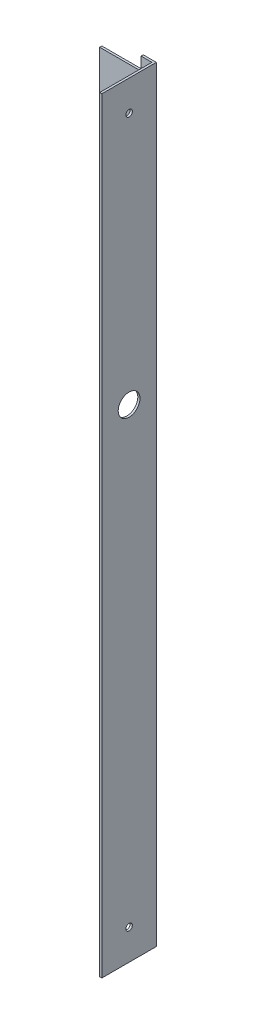
ISO-10303-21;
HEADER;
FILE_DESCRIPTION(('STEP AP214'),'2;1');
FILE_NAME('part.step','',(''),(''),'','','');
FILE_SCHEMA(('AUTOMOTIVE_DESIGN { 1 0 10303 214 1 1 1 1 }'));
ENDSEC;
DATA;
#1=APPLICATION_CONTEXT('core data for automotive mechanical design processes');
#2=APPLICATION_PROTOCOL_DEFINITION('international standard','automotive_design',2000,#1);
#3=PRODUCT_CONTEXT('',#1,'mechanical');
#4=PRODUCT('Part','Part','',(#3));
#5=PRODUCT_RELATED_PRODUCT_CATEGORY('part','',(#4));
#6=PRODUCT_DEFINITION_FORMATION('','',#4);
#7=PRODUCT_DEFINITION_CONTEXT('part definition',#1,'design');
#8=PRODUCT_DEFINITION('design','',#6,#7);
#9=PRODUCT_DEFINITION_SHAPE('','',#8);
#10=(LENGTH_UNIT() NAMED_UNIT(*) SI_UNIT(.MILLI.,.METRE.));
#11=(NAMED_UNIT(*) PLANE_ANGLE_UNIT() SI_UNIT($,.RADIAN.));
#12=(NAMED_UNIT(*) SI_UNIT($,.STERADIAN.) SOLID_ANGLE_UNIT());
#13=UNCERTAINTY_MEASURE_WITH_UNIT(LENGTH_MEASURE(1.E-05),#10,'distance_accuracy_value','');
#14=(GEOMETRIC_REPRESENTATION_CONTEXT(3) GLOBAL_UNCERTAINTY_ASSIGNED_CONTEXT((#13)) GLOBAL_UNIT_ASSIGNED_CONTEXT((#10,
#11,#12)) REPRESENTATION_CONTEXT('',''));
#15=CARTESIAN_POINT('',(0.,0.,0.));
#16=DIRECTION('',(0.,0.,1.));
#17=DIRECTION('',(1.,0.,0.));
#18=AXIS2_PLACEMENT_3D('',#15,#16,#17);
#19=CARTESIAN_POINT('',(-56.3400048408916,62.1803752262785,25.));
#20=DIRECTION('',(1.,0.,0.));
#21=DIRECTION('',(0.,1.,0.));
#22=AXIS2_PLACEMENT_3D('',#19,#20,#21);
#23=PLANE('',#22);
#24=CARTESIAN_POINT('',(-56.3400048408916,48.1803752262785,12.5));
#25=DIRECTION('',(1.,0.,0.));
#26=DIRECTION('',(0.,1.,0.));
#27=AXIS2_PLACEMENT_3D('',#24,#25,#26);
#28=CIRCLE('',#27,1.5);
#29=CARTESIAN_POINT('',(-56.3400048408916,49.6803752262785,12.5));
#30=VERTEX_POINT('',#29);
#31=EDGE_CURVE('E188',#30,#30,#28,.T.);
#32=ORIENTED_EDGE('',*,*,#31,.T.);
#33=EDGE_LOOP('',(#32));
#34=FACE_BOUND('',#33,.T.);
#35=CARTESIAN_POINT('',(-56.3400048408916,-275.819624773722,12.5));
#36=DIRECTION('',(1.,0.,0.));
#37=DIRECTION('',(0.,1.,0.));
#38=AXIS2_PLACEMENT_3D('',#35,#36,#37);
#39=CIRCLE('',#38,1.5);
#40=CARTESIAN_POINT('',(-56.3400048408916,-274.319624773722,12.5));
#41=VERTEX_POINT('',#40);
#42=EDGE_CURVE('E182',#41,#41,#39,.T.);
#43=ORIENTED_EDGE('',*,*,#42,.T.);
#44=EDGE_LOOP('',(#43));
#45=FACE_BOUND('',#44,.T.);
#46=CARTESIAN_POINT('',(-56.3400048408916,-67.8196247737215,12.5));
#47=DIRECTION('',(1.,0.,0.));
#48=DIRECTION('',(0.,1.,0.));
#49=AXIS2_PLACEMENT_3D('',#46,#47,#48);
#50=CIRCLE('',#49,5.00000000000001);
#51=CARTESIAN_POINT('',(-56.3400048408916,-62.8196247737215,12.5));
#52=VERTEX_POINT('',#51);
#53=EDGE_CURVE('E173',#52,#52,#50,.T.);
#54=ORIENTED_EDGE('',*,*,#53,.T.);
#55=EDGE_LOOP('',(#54));
#56=FACE_BOUND('',#55,.T.);
#57=DIRECTION('',(0.,1.,0.));
#58=VECTOR('',#57,1.);
#59=CARTESIAN_POINT('',(-56.3400048408916,-289.819624773722,1.));
#60=LINE('',#59,#58);
#61=CARTESIAN_POINT('',(-56.3400048408916,-289.819624773722,1.));
#62=VERTEX_POINT('',#61);
#63=CARTESIAN_POINT('',(-56.3400048408916,62.1803752262785,1.));
#64=VERTEX_POINT('',#63);
#65=EDGE_CURVE('E49',#62,#64,#60,.T.);
#66=ORIENTED_EDGE('',*,*,#65,.F.);
#67=DIRECTION('',(0.,0.,-1.));
#68=VECTOR('',#67,1.);
#69=CARTESIAN_POINT('',(-56.3400048408916,-289.819624773722,25.));
#70=LINE('',#69,#68);
#71=CARTESIAN_POINT('',(-56.3400048408916,-289.819624773722,25.));
#72=VERTEX_POINT('',#71);
#73=EDGE_CURVE('E11',#72,#62,#70,.T.);
#74=ORIENTED_EDGE('',*,*,#73,.F.);
#75=DIRECTION('',(0.,-1.,0.));
#76=VECTOR('',#75,1.);
#77=CARTESIAN_POINT('',(-56.3400048408916,62.1803752262785,25.));
#78=LINE('',#77,#76);
#79=CARTESIAN_POINT('',(-56.3400048408916,62.1803752262785,25.));
#80=VERTEX_POINT('',#79);
#81=EDGE_CURVE('E194',#80,#72,#78,.T.);
#82=ORIENTED_EDGE('',*,*,#81,.F.);
#83=DIRECTION('',(0.,0.,-1.));
#84=VECTOR('',#83,1.);
#85=CARTESIAN_POINT('',(-56.3400048408916,62.1803752262785,25.));
#86=LINE('',#85,#84);
#87=EDGE_CURVE('E201',#80,#64,#86,.T.);
#88=ORIENTED_EDGE('',*,*,#87,.T.);
#89=EDGE_LOOP('',(#66,#74,#82,#88));
#90=FACE_BOUND('',#89,.T.);
#91=ADVANCED_FACE('F33',(#34,#45,#56,#90),#23,.F.);
#92=CARTESIAN_POINT('',(-56.3400048408916,-289.819624773722,25.));
#93=DIRECTION('',(0.,1.,0.));
#94=DIRECTION('',(0.,0.,1.));
#95=AXIS2_PLACEMENT_3D('',#92,#93,#94);
#96=PLANE('',#95);
#97=DIRECTION('',(1.,0.,0.));
#98=VECTOR('',#97,1.);
#99=CARTESIAN_POINT('',(-56.3400048408916,-289.819624773722,0.));
#100=LINE('',#99,#98);
#101=CARTESIAN_POINT('',(-61.3400048408916,-289.819624773722,0.));
#102=VERTEX_POINT('',#101);
#103=CARTESIAN_POINT('',(-55.3400048408916,-289.819624773722,0.));
#104=VERTEX_POINT('',#103);
#105=EDGE_CURVE('E191',#102,#104,#100,.T.);
#106=ORIENTED_EDGE('',*,*,#105,.T.);
#107=DIRECTION('',(0.,0.,-1.));
#108=VECTOR('',#107,1.);
#109=CARTESIAN_POINT('',(-55.3400048408916,-289.819624773722,25.));
#110=LINE('',#109,#108);
#111=CARTESIAN_POINT('',(-55.3400048408916,-289.819624773722,25.));
#112=VERTEX_POINT('',#111);
#113=EDGE_CURVE('E41',#112,#104,#110,.T.);
#114=ORIENTED_EDGE('',*,*,#113,.F.);
#115=DIRECTION('',(1.,0.,0.));
#116=VECTOR('',#115,1.);
#117=CARTESIAN_POINT('',(-56.3400048408916,-289.819624773722,25.));
#118=LINE('',#117,#116);
#119=EDGE_CURVE('E80',#72,#112,#118,.T.);
#120=ORIENTED_EDGE('',*,*,#119,.F.);
#121=ORIENTED_EDGE('',*,*,#73,.T.);
#122=DIRECTION('',(1.,0.,0.));
#123=VECTOR('',#122,1.);
#124=CARTESIAN_POINT('',(-61.3400048408916,-289.819624773722,1.));
#125=LINE('',#124,#123);
#126=CARTESIAN_POINT('',(-61.3400048408916,-289.819624773722,1.));
#127=VERTEX_POINT('',#126);
#128=EDGE_CURVE('E214',#127,#62,#125,.T.);
#129=ORIENTED_EDGE('',*,*,#128,.F.);
#130=DIRECTION('',(0.,0.,-1.));
#131=VECTOR('',#130,1.);
#132=CARTESIAN_POINT('',(-61.3400048408916,-289.819624773722,1.));
#133=LINE('',#132,#131);
#134=EDGE_CURVE('E240',#127,#102,#133,.T.);
#135=ORIENTED_EDGE('',*,*,#134,.T.);
#136=EDGE_LOOP('',(#106,#114,#120,#121,#129,#135));
#137=FACE_BOUND('',#136,.T.);
#138=ADVANCED_FACE('F296',(#137),#96,.F.);
#139=CARTESIAN_POINT('',(-55.3400048408916,62.1803752262785,25.));
#140=DIRECTION('',(-1.,0.,0.));
#141=DIRECTION('',(0.,-1.,0.));
#142=AXIS2_PLACEMENT_3D('',#139,#140,#141);
#143=PLANE('',#142);
#144=CARTESIAN_POINT('',(-55.3400048408916,-67.8196247737215,12.5));
#145=DIRECTION('',(1.,0.,0.));
#146=DIRECTION('',(0.,1.,0.));
#147=AXIS2_PLACEMENT_3D('',#144,#145,#146);
#148=CIRCLE('',#147,5.00000000000001);
#149=CARTESIAN_POINT('',(-55.3400048408916,-62.8196247737215,12.5));
#150=VERTEX_POINT('',#149);
#151=EDGE_CURVE('E170',#150,#150,#148,.T.);
#152=ORIENTED_EDGE('',*,*,#151,.F.);
#153=EDGE_LOOP('',(#152));
#154=FACE_BOUND('',#153,.T.);
#155=CARTESIAN_POINT('',(-55.3400048408916,-275.819624773722,12.5));
#156=DIRECTION('',(1.,0.,0.));
#157=DIRECTION('',(0.,1.,0.));
#158=AXIS2_PLACEMENT_3D('',#155,#156,#157);
#159=CIRCLE('',#158,1.5);
#160=CARTESIAN_POINT('',(-55.3400048408916,-274.319624773722,12.5));
#161=VERTEX_POINT('',#160);
#162=EDGE_CURVE('E180',#161,#161,#159,.T.);
#163=ORIENTED_EDGE('',*,*,#162,.F.);
#164=EDGE_LOOP('',(#163));
#165=FACE_BOUND('',#164,.T.);
#166=CARTESIAN_POINT('',(-55.3400048408916,48.1803752262785,12.5));
#167=DIRECTION('',(1.,0.,0.));
#168=DIRECTION('',(0.,1.,0.));
#169=AXIS2_PLACEMENT_3D('',#166,#167,#168);
#170=CIRCLE('',#169,1.5);
#171=CARTESIAN_POINT('',(-55.3400048408916,49.6803752262785,12.5));
#172=VERTEX_POINT('',#171);
#173=EDGE_CURVE('E185',#172,#172,#170,.T.);
#174=ORIENTED_EDGE('',*,*,#173,.F.);
#175=EDGE_LOOP('',(#174));
#176=FACE_BOUND('',#175,.T.);
#177=DIRECTION('',(0.,1.,0.));
#178=VECTOR('',#177,1.);
#179=CARTESIAN_POINT('',(-55.3400048408916,62.1803752262785,0.));
#180=LINE('',#179,#178);
#181=CARTESIAN_POINT('',(-55.3400048408916,62.1803752262785,0.));
#182=VERTEX_POINT('',#181);
#183=EDGE_CURVE('E73',#104,#182,#180,.T.);
#184=ORIENTED_EDGE('',*,*,#183,.T.);
#185=DIRECTION('',(0.,0.,-1.));
#186=VECTOR('',#185,1.);
#187=CARTESIAN_POINT('',(-55.3400048408916,62.1803752262785,25.));
#188=LINE('',#187,#186);
#189=CARTESIAN_POINT('',(-55.3400048408916,62.1803752262785,25.));
#190=VERTEX_POINT('',#189);
#191=EDGE_CURVE('E207',#190,#182,#188,.T.);
#192=ORIENTED_EDGE('',*,*,#191,.F.);
#193=DIRECTION('',(0.,1.,0.));
#194=VECTOR('',#193,1.);
#195=CARTESIAN_POINT('',(-55.3400048408916,62.1803752262785,25.));
#196=LINE('',#195,#194);
#197=EDGE_CURVE('E198',#112,#190,#196,.T.);
#198=ORIENTED_EDGE('',*,*,#197,.F.);
#199=ORIENTED_EDGE('',*,*,#113,.T.);
#200=EDGE_LOOP('',(#184,#192,#198,#199));
#201=FACE_BOUND('',#200,.T.);
#202=ADVANCED_FACE('F300',(#154,#165,#176,#201),#143,.F.);
#203=CARTESIAN_POINT('',(-56.3400048408916,62.1803752262785,25.));
#204=DIRECTION('',(0.,-1.,0.));
#205=DIRECTION('',(0.,0.,-1.));
#206=AXIS2_PLACEMENT_3D('',#203,#204,#205);
#207=PLANE('',#206);
#208=DIRECTION('',(-1.,0.,0.));
#209=VECTOR('',#208,1.);
#210=CARTESIAN_POINT('',(-56.3400048408916,62.1803752262785,0.));
#211=LINE('',#210,#209);
#212=CARTESIAN_POINT('',(-61.3400048408916,62.1803752262785,0.));
#213=VERTEX_POINT('',#212);
#214=EDGE_CURVE('E196',#182,#213,#211,.T.);
#215=ORIENTED_EDGE('',*,*,#214,.T.);
#216=DIRECTION('',(0.,0.,-1.));
#217=VECTOR('',#216,1.);
#218=CARTESIAN_POINT('',(-61.3400048408916,62.1803752262785,1.));
#219=LINE('',#218,#217);
#220=CARTESIAN_POINT('',(-61.3400048408916,62.1803752262785,1.));
#221=VERTEX_POINT('',#220);
#222=EDGE_CURVE('E238',#221,#213,#219,.T.);
#223=ORIENTED_EDGE('',*,*,#222,.F.);
#224=DIRECTION('',(-1.,0.,0.));
#225=VECTOR('',#224,1.);
#226=CARTESIAN_POINT('',(-56.3400048408916,62.1803752262785,1.));
#227=LINE('',#226,#225);
#228=EDGE_CURVE('E161',#64,#221,#227,.T.);
#229=ORIENTED_EDGE('',*,*,#228,.F.);
#230=ORIENTED_EDGE('',*,*,#87,.F.);
#231=DIRECTION('',(-1.,0.,0.));
#232=VECTOR('',#231,1.);
#233=CARTESIAN_POINT('',(-56.3400048408916,62.1803752262785,25.));
#234=LINE('',#233,#232);
#235=EDGE_CURVE('E57',#190,#80,#234,.T.);
#236=ORIENTED_EDGE('',*,*,#235,.F.);
#237=ORIENTED_EDGE('',*,*,#191,.T.);
#238=EDGE_LOOP('',(#215,#223,#229,#230,#236,#237));
#239=FACE_BOUND('',#238,.T.);
#240=ADVANCED_FACE('F303',(#239),#207,.F.);
#241=CARTESIAN_POINT('',(0.,0.,25.));
#242=DIRECTION('',(0.,0.,1.));
#243=DIRECTION('',(1.,0.,0.));
#244=AXIS2_PLACEMENT_3D('',#241,#242,#243);
#245=PLANE('',#244);
#246=ORIENTED_EDGE('',*,*,#81,.T.);
#247=ORIENTED_EDGE('',*,*,#119,.T.);
#248=ORIENTED_EDGE('',*,*,#197,.T.);
#249=ORIENTED_EDGE('',*,*,#235,.T.);
#250=EDGE_LOOP('',(#246,#247,#248,#249));
#251=FACE_BOUND('',#250,.T.);
#252=ADVANCED_FACE('F298',(#251),#245,.T.);
#253=CARTESIAN_POINT('',(0.,0.,0.));
#254=DIRECTION('',(0.,0.,1.));
#255=DIRECTION('',(1.,0.,0.));
#256=AXIS2_PLACEMENT_3D('',#253,#254,#255);
#257=PLANE('',#256);
#258=ORIENTED_EDGE('',*,*,#105,.F.);
#259=DIRECTION('',(0.,-1.,0.));
#260=VECTOR('',#259,1.);
#261=CARTESIAN_POINT('',(-61.3400048408916,-283.819624773722,0.));
#262=LINE('',#261,#260);
#263=CARTESIAN_POINT('',(-61.3400048408916,-283.819624773722,0.));
#264=VERTEX_POINT('',#263);
#265=EDGE_CURVE('E165',#264,#102,#262,.T.);
#266=ORIENTED_EDGE('',*,*,#265,.F.);
#267=DIRECTION('',(1.,0.,0.));
#268=VECTOR('',#267,1.);
#269=CARTESIAN_POINT('',(-80.3400048408922,-283.819624773722,0.));
#270=LINE('',#269,#268);
#271=CARTESIAN_POINT('',(-80.3400048408922,-283.819624773722,0.));
#272=VERTEX_POINT('',#271);
#273=EDGE_CURVE('E234',#272,#264,#270,.T.);
#274=ORIENTED_EDGE('',*,*,#273,.F.);
#275=DIRECTION('',(0.,-1.,0.));
#276=VECTOR('',#275,1.);
#277=CARTESIAN_POINT('',(-80.3400048408922,-213.819624773722,0.));
#278=LINE('',#277,#276);
#279=CARTESIAN_POINT('',(-80.3400048408922,-213.819624773722,0.));
#280=VERTEX_POINT('',#279);
#281=EDGE_CURVE('E232',#280,#272,#278,.T.);
#282=ORIENTED_EDGE('',*,*,#281,.F.);
#283=DIRECTION('',(-1.,0.,0.));
#284=VECTOR('',#283,1.);
#285=CARTESIAN_POINT('',(-61.3400048408916,-213.819624773722,0.));
#286=LINE('',#285,#284);
#287=CARTESIAN_POINT('',(-61.3400048408916,-213.819624773722,0.));
#288=VERTEX_POINT('',#287);
#289=EDGE_CURVE('E230',#288,#280,#286,.T.);
#290=ORIENTED_EDGE('',*,*,#289,.F.);
#291=DIRECTION('',(0.,-1.,0.));
#292=VECTOR('',#291,1.);
#293=CARTESIAN_POINT('',(-61.3400048408916,-13.8196247737216,0.));
#294=LINE('',#293,#292);
#295=CARTESIAN_POINT('',(-61.3400048408916,-13.8196247737216,0.));
#296=VERTEX_POINT('',#295);
#297=EDGE_CURVE('E228',#296,#288,#294,.T.);
#298=ORIENTED_EDGE('',*,*,#297,.F.);
#299=DIRECTION('',(1.,0.,0.));
#300=VECTOR('',#299,1.);
#301=CARTESIAN_POINT('',(-80.3400048408922,-13.8196247737216,0.));
#302=LINE('',#301,#300);
#303=CARTESIAN_POINT('',(-80.3400048408922,-13.8196247737216,0.));
#304=VERTEX_POINT('',#303);
#305=EDGE_CURVE('E226',#304,#296,#302,.T.);
#306=ORIENTED_EDGE('',*,*,#305,.F.);
#307=DIRECTION('',(0.,-1.,0.));
#308=VECTOR('',#307,1.);
#309=CARTESIAN_POINT('',(-80.3400048408922,56.1803752262785,0.));
#310=LINE('',#309,#308);
#311=CARTESIAN_POINT('',(-80.3400048408922,56.1803752262785,0.));
#312=VERTEX_POINT('',#311);
#313=EDGE_CURVE('E224',#312,#304,#310,.T.);
#314=ORIENTED_EDGE('',*,*,#313,.F.);
#315=DIRECTION('',(-1.,0.,0.));
#316=VECTOR('',#315,1.);
#317=CARTESIAN_POINT('',(-61.3400048408916,56.1803752262785,0.));
#318=LINE('',#317,#316);
#319=CARTESIAN_POINT('',(-61.3400048408916,56.1803752262785,0.));
#320=VERTEX_POINT('',#319);
#321=EDGE_CURVE('E222',#320,#312,#318,.T.);
#322=ORIENTED_EDGE('',*,*,#321,.F.);
#323=DIRECTION('',(0.,-1.,0.));
#324=VECTOR('',#323,1.);
#325=CARTESIAN_POINT('',(-61.3400048408916,62.1803752262785,0.));
#326=LINE('',#325,#324);
#327=EDGE_CURVE('E169',#213,#320,#326,.T.);
#328=ORIENTED_EDGE('',*,*,#327,.F.);
#329=ORIENTED_EDGE('',*,*,#214,.F.);
#330=ORIENTED_EDGE('',*,*,#183,.F.);
#331=EDGE_LOOP('',(#258,#266,#274,#282,#290,#298,#306,#314,#322,#328,#329,#330));
#332=FACE_BOUND('',#331,.T.);
#333=ADVANCED_FACE('F269',(#332),#257,.F.);
#334=CARTESIAN_POINT('',(-56.3400048408916,48.1803752262785,12.5));
#335=DIRECTION('',(1.,0.,0.));
#336=DIRECTION('',(0.,1.,0.));
#337=AXIS2_PLACEMENT_3D('',#334,#335,#336);
#338=CYLINDRICAL_SURFACE('',#337,1.5);
#339=ORIENTED_EDGE('',*,*,#31,.F.);
#340=EDGE_LOOP('',(#339));
#341=FACE_BOUND('',#340,.T.);
#342=ORIENTED_EDGE('',*,*,#173,.T.);
#343=EDGE_LOOP('',(#342));
#344=FACE_BOUND('',#343,.T.);
#345=ADVANCED_FACE('F339',(#341,#344),#338,.F.);
#346=CARTESIAN_POINT('',(-56.3400048408916,-275.819624773722,12.5));
#347=DIRECTION('',(1.,0.,0.));
#348=DIRECTION('',(0.,1.,0.));
#349=AXIS2_PLACEMENT_3D('',#346,#347,#348);
#350=CYLINDRICAL_SURFACE('',#349,1.5);
#351=ORIENTED_EDGE('',*,*,#42,.F.);
#352=EDGE_LOOP('',(#351));
#353=FACE_BOUND('',#352,.T.);
#354=ORIENTED_EDGE('',*,*,#162,.T.);
#355=EDGE_LOOP('',(#354));
#356=FACE_BOUND('',#355,.T.);
#357=ADVANCED_FACE('F328',(#353,#356),#350,.F.);
#358=CARTESIAN_POINT('',(-56.3400048408916,-67.8196247737215,12.5));
#359=DIRECTION('',(1.,0.,0.));
#360=DIRECTION('',(0.,1.,0.));
#361=AXIS2_PLACEMENT_3D('',#358,#359,#360);
#362=CYLINDRICAL_SURFACE('',#361,5.00000000000001);
#363=ORIENTED_EDGE('',*,*,#53,.F.);
#364=EDGE_LOOP('',(#363));
#365=FACE_BOUND('',#364,.T.);
#366=ORIENTED_EDGE('',*,*,#151,.T.);
#367=EDGE_LOOP('',(#366));
#368=FACE_BOUND('',#367,.T.);
#369=ADVANCED_FACE('F325',(#365,#368),#362,.F.);
#370=CARTESIAN_POINT('',(-61.3400048408916,62.1803752262785,1.));
#371=DIRECTION('',(1.,0.,0.));
#372=DIRECTION('',(0.,0.,-1.));
#373=AXIS2_PLACEMENT_3D('',#370,#371,#372);
#374=PLANE('',#373);
#375=ORIENTED_EDGE('',*,*,#327,.T.);
#376=DIRECTION('',(0.,0.,-1.));
#377=VECTOR('',#376,1.);
#378=CARTESIAN_POINT('',(-61.3400048408916,56.1803752262785,1.));
#379=LINE('',#378,#377);
#380=CARTESIAN_POINT('',(-61.3400048408916,56.1803752262785,1.));
#381=VERTEX_POINT('',#380);
#382=EDGE_CURVE('E149',#381,#320,#379,.T.);
#383=ORIENTED_EDGE('',*,*,#382,.F.);
#384=DIRECTION('',(0.,-1.,0.));
#385=VECTOR('',#384,1.);
#386=CARTESIAN_POINT('',(-61.3400048408916,62.1803752262785,1.));
#387=LINE('',#386,#385);
#388=EDGE_CURVE('E156',#221,#381,#387,.T.);
#389=ORIENTED_EDGE('',*,*,#388,.F.);
#390=ORIENTED_EDGE('',*,*,#222,.T.);
#391=EDGE_LOOP('',(#375,#383,#389,#390));
#392=FACE_BOUND('',#391,.T.);
#393=ADVANCED_FACE('F167',(#392),#374,.F.);
#394=CARTESIAN_POINT('',(-61.3400048408916,56.1803752262785,1.));
#395=DIRECTION('',(0.,-1.,0.));
#396=DIRECTION('',(0.,0.,-1.));
#397=AXIS2_PLACEMENT_3D('',#394,#395,#396);
#398=PLANE('',#397);
#399=ORIENTED_EDGE('',*,*,#321,.T.);
#400=DIRECTION('',(0.,0.,-1.));
#401=VECTOR('',#400,1.);
#402=CARTESIAN_POINT('',(-80.3400048408922,56.1803752262785,1.));
#403=LINE('',#402,#401);
#404=CARTESIAN_POINT('',(-80.3400048408922,56.1803752262785,1.));
#405=VERTEX_POINT('',#404);
#406=EDGE_CURVE('E152',#405,#312,#403,.T.);
#407=ORIENTED_EDGE('',*,*,#406,.F.);
#408=DIRECTION('',(-1.,0.,0.));
#409=VECTOR('',#408,1.);
#410=CARTESIAN_POINT('',(-61.3400048408916,56.1803752262785,1.));
#411=LINE('',#410,#409);
#412=EDGE_CURVE('E145',#381,#405,#411,.T.);
#413=ORIENTED_EDGE('',*,*,#412,.F.);
#414=ORIENTED_EDGE('',*,*,#382,.T.);
#415=EDGE_LOOP('',(#399,#407,#413,#414));
#416=FACE_BOUND('',#415,.T.);
#417=ADVANCED_FACE('F147',(#416),#398,.F.);
#418=CARTESIAN_POINT('',(-80.3400048408922,56.1803752262785,1.));
#419=DIRECTION('',(1.,0.,0.));
#420=DIRECTION('',(0.,1.,0.));
#421=AXIS2_PLACEMENT_3D('',#418,#419,#420);
#422=PLANE('',#421);
#423=ORIENTED_EDGE('',*,*,#313,.T.);
#424=DIRECTION('',(0.,0.,-1.));
#425=VECTOR('',#424,1.);
#426=CARTESIAN_POINT('',(-80.3400048408922,-13.8196247737216,1.));
#427=LINE('',#426,#425);
#428=CARTESIAN_POINT('',(-80.3400048408922,-13.8196247737216,1.));
#429=VERTEX_POINT('',#428);
#430=EDGE_CURVE('E175',#429,#304,#427,.T.);
#431=ORIENTED_EDGE('',*,*,#430,.F.);
#432=DIRECTION('',(0.,-1.,0.));
#433=VECTOR('',#432,1.);
#434=CARTESIAN_POINT('',(-80.3400048408922,56.1803752262785,1.));
#435=LINE('',#434,#433);
#436=EDGE_CURVE('E155',#405,#429,#435,.T.);
#437=ORIENTED_EDGE('',*,*,#436,.F.);
#438=ORIENTED_EDGE('',*,*,#406,.T.);
#439=EDGE_LOOP('',(#423,#431,#437,#438));
#440=FACE_BOUND('',#439,.T.);
#441=ADVANCED_FACE('F304',(#440),#422,.F.);
#442=CARTESIAN_POINT('',(-80.3400048408922,-13.8196247737216,1.));
#443=DIRECTION('',(0.,1.,0.));
#444=DIRECTION('',(0.,0.,1.));
#445=AXIS2_PLACEMENT_3D('',#442,#443,#444);
#446=PLANE('',#445);
#447=ORIENTED_EDGE('',*,*,#305,.T.);
#448=DIRECTION('',(0.,0.,-1.));
#449=VECTOR('',#448,1.);
#450=CARTESIAN_POINT('',(-61.3400048408916,-13.8196247737216,1.));
#451=LINE('',#450,#449);
#452=CARTESIAN_POINT('',(-61.3400048408916,-13.8196247737216,1.));
#453=VERTEX_POINT('',#452);
#454=EDGE_CURVE('E255',#453,#296,#451,.T.);
#455=ORIENTED_EDGE('',*,*,#454,.F.);
#456=DIRECTION('',(1.,0.,0.));
#457=VECTOR('',#456,1.);
#458=CARTESIAN_POINT('',(-80.3400048408922,-13.8196247737216,1.));
#459=LINE('',#458,#457);
#460=EDGE_CURVE('E264',#429,#453,#459,.T.);
#461=ORIENTED_EDGE('',*,*,#460,.F.);
#462=ORIENTED_EDGE('',*,*,#430,.T.);
#463=EDGE_LOOP('',(#447,#455,#461,#462));
#464=FACE_BOUND('',#463,.T.);
#465=ADVANCED_FACE('F262',(#464),#446,.F.);
#466=CARTESIAN_POINT('',(-61.3400048408916,-13.8196247737216,1.));
#467=DIRECTION('',(1.,0.,0.));
#468=DIRECTION('',(0.,1.,0.));
#469=AXIS2_PLACEMENT_3D('',#466,#467,#468);
#470=PLANE('',#469);
#471=ORIENTED_EDGE('',*,*,#297,.T.);
#472=DIRECTION('',(0.,0.,-1.));
#473=VECTOR('',#472,1.);
#474=CARTESIAN_POINT('',(-61.3400048408916,-213.819624773722,1.));
#475=LINE('',#474,#473);
#476=CARTESIAN_POINT('',(-61.3400048408916,-213.819624773722,1.));
#477=VERTEX_POINT('',#476);
#478=EDGE_CURVE('E252',#477,#288,#475,.T.);
#479=ORIENTED_EDGE('',*,*,#478,.F.);
#480=DIRECTION('',(0.,-1.,0.));
#481=VECTOR('',#480,1.);
#482=CARTESIAN_POINT('',(-61.3400048408916,-13.8196247737216,1.));
#483=LINE('',#482,#481);
#484=EDGE_CURVE('E283',#453,#477,#483,.T.);
#485=ORIENTED_EDGE('',*,*,#484,.F.);
#486=ORIENTED_EDGE('',*,*,#454,.T.);
#487=EDGE_LOOP('',(#471,#479,#485,#486));
#488=FACE_BOUND('',#487,.T.);
#489=ADVANCED_FACE('F274',(#488),#470,.F.);
#490=CARTESIAN_POINT('',(-61.3400048408916,-213.819624773722,1.));
#491=DIRECTION('',(0.,-1.,0.));
#492=DIRECTION('',(1.,0.,0.));
#493=AXIS2_PLACEMENT_3D('',#490,#491,#492);
#494=PLANE('',#493);
#495=ORIENTED_EDGE('',*,*,#289,.T.);
#496=DIRECTION('',(0.,0.,-1.));
#497=VECTOR('',#496,1.);
#498=CARTESIAN_POINT('',(-80.3400048408922,-213.819624773722,1.));
#499=LINE('',#498,#497);
#500=CARTESIAN_POINT('',(-80.3400048408922,-213.819624773722,1.));
#501=VERTEX_POINT('',#500);
#502=EDGE_CURVE('E249',#501,#280,#499,.T.);
#503=ORIENTED_EDGE('',*,*,#502,.F.);
#504=DIRECTION('',(-1.,0.,0.));
#505=VECTOR('',#504,1.);
#506=CARTESIAN_POINT('',(-61.3400048408916,-213.819624773722,1.));
#507=LINE('',#506,#505);
#508=EDGE_CURVE('E280',#477,#501,#507,.T.);
#509=ORIENTED_EDGE('',*,*,#508,.F.);
#510=ORIENTED_EDGE('',*,*,#478,.T.);
#511=EDGE_LOOP('',(#495,#503,#509,#510));
#512=FACE_BOUND('',#511,.T.);
#513=ADVANCED_FACE('F278',(#512),#494,.F.);
#514=CARTESIAN_POINT('',(-80.3400048408922,-213.819624773722,1.));
#515=DIRECTION('',(1.,0.,0.));
#516=DIRECTION('',(0.,0.,-1.));
#517=AXIS2_PLACEMENT_3D('',#514,#515,#516);
#518=PLANE('',#517);
#519=ORIENTED_EDGE('',*,*,#281,.T.);
#520=DIRECTION('',(0.,0.,-1.));
#521=VECTOR('',#520,1.);
#522=CARTESIAN_POINT('',(-80.3400048408922,-283.819624773722,1.));
#523=LINE('',#522,#521);
#524=CARTESIAN_POINT('',(-80.3400048408922,-283.819624773722,1.));
#525=VERTEX_POINT('',#524);
#526=EDGE_CURVE('E246',#525,#272,#523,.T.);
#527=ORIENTED_EDGE('',*,*,#526,.F.);
#528=DIRECTION('',(0.,-1.,0.));
#529=VECTOR('',#528,1.);
#530=CARTESIAN_POINT('',(-80.3400048408922,-213.819624773722,1.));
#531=LINE('',#530,#529);
#532=EDGE_CURVE('E282',#501,#525,#531,.T.);
#533=ORIENTED_EDGE('',*,*,#532,.F.);
#534=ORIENTED_EDGE('',*,*,#502,.T.);
#535=EDGE_LOOP('',(#519,#527,#533,#534));
#536=FACE_BOUND('',#535,.T.);
#537=ADVANCED_FACE('F409',(#536),#518,.F.);
#538=CARTESIAN_POINT('',(-80.3400048408922,-283.819624773722,1.));
#539=DIRECTION('',(0.,1.,0.));
#540=DIRECTION('',(0.,0.,1.));
#541=AXIS2_PLACEMENT_3D('',#538,#539,#540);
#542=PLANE('',#541);
#543=ORIENTED_EDGE('',*,*,#273,.T.);
#544=DIRECTION('',(0.,0.,-1.));
#545=VECTOR('',#544,1.);
#546=CARTESIAN_POINT('',(-61.3400048408916,-283.819624773722,1.));
#547=LINE('',#546,#545);
#548=CARTESIAN_POINT('',(-61.3400048408916,-283.819624773722,1.));
#549=VERTEX_POINT('',#548);
#550=EDGE_CURVE('E243',#549,#264,#547,.T.);
#551=ORIENTED_EDGE('',*,*,#550,.F.);
#552=DIRECTION('',(1.,0.,0.));
#553=VECTOR('',#552,1.);
#554=CARTESIAN_POINT('',(-80.3400048408922,-283.819624773722,1.));
#555=LINE('',#554,#553);
#556=EDGE_CURVE('E285',#525,#549,#555,.T.);
#557=ORIENTED_EDGE('',*,*,#556,.F.);
#558=ORIENTED_EDGE('',*,*,#526,.T.);
#559=EDGE_LOOP('',(#543,#551,#557,#558));
#560=FACE_BOUND('',#559,.T.);
#561=ADVANCED_FACE('F418',(#560),#542,.F.);
#562=CARTESIAN_POINT('',(-61.3400048408916,-283.819624773722,1.));
#563=DIRECTION('',(1.,0.,0.));
#564=DIRECTION('',(0.,0.,-1.));
#565=AXIS2_PLACEMENT_3D('',#562,#563,#564);
#566=PLANE('',#565);
#567=ORIENTED_EDGE('',*,*,#265,.T.);
#568=ORIENTED_EDGE('',*,*,#134,.F.);
#569=DIRECTION('',(0.,-1.,0.));
#570=VECTOR('',#569,1.);
#571=CARTESIAN_POINT('',(-61.3400048408916,-283.819624773722,1.));
#572=LINE('',#571,#570);
#573=EDGE_CURVE('E219',#549,#127,#572,.T.);
#574=ORIENTED_EDGE('',*,*,#573,.F.);
#575=ORIENTED_EDGE('',*,*,#550,.T.);
#576=EDGE_LOOP('',(#567,#568,#574,#575));
#577=FACE_BOUND('',#576,.T.);
#578=ADVANCED_FACE('F428',(#577),#566,.F.);
#579=CARTESIAN_POINT('',(0.,0.,1.));
#580=DIRECTION('',(0.,0.,-1.));
#581=DIRECTION('',(-1.,0.,0.));
#582=AXIS2_PLACEMENT_3D('',#579,#580,#581);
#583=PLANE('',#582);
#584=ORIENTED_EDGE('',*,*,#388,.T.);
#585=ORIENTED_EDGE('',*,*,#412,.T.);
#586=ORIENTED_EDGE('',*,*,#436,.T.);
#587=ORIENTED_EDGE('',*,*,#460,.T.);
#588=ORIENTED_EDGE('',*,*,#484,.T.);
#589=ORIENTED_EDGE('',*,*,#508,.T.);
#590=ORIENTED_EDGE('',*,*,#532,.T.);
#591=ORIENTED_EDGE('',*,*,#556,.T.);
#592=ORIENTED_EDGE('',*,*,#573,.T.);
#593=ORIENTED_EDGE('',*,*,#128,.T.);
#594=ORIENTED_EDGE('',*,*,#65,.T.);
#595=ORIENTED_EDGE('',*,*,#228,.T.);
#596=EDGE_LOOP('',(#584,#585,#586,#587,#588,#589,#590,#591,#592,#593,#594,#595));
#597=FACE_BOUND('',#596,.T.);
#598=ADVANCED_FACE('F159',(#597),#583,.F.);
#599=CLOSED_SHELL('',(#91,#138,#202,#240,#252,#333,#345,#357,#369,#393,#417,#441,#465,#489,#513,
#537,#561,#578,#598));
#600=MANIFOLD_SOLID_BREP('B2',#599);
#601=ADVANCED_BREP_SHAPE_REPRESENTATION('',(#18,#600),#14);
#602=SHAPE_DEFINITION_REPRESENTATION(#9,#601);
ENDSEC;
END-ISO-10303-21;
